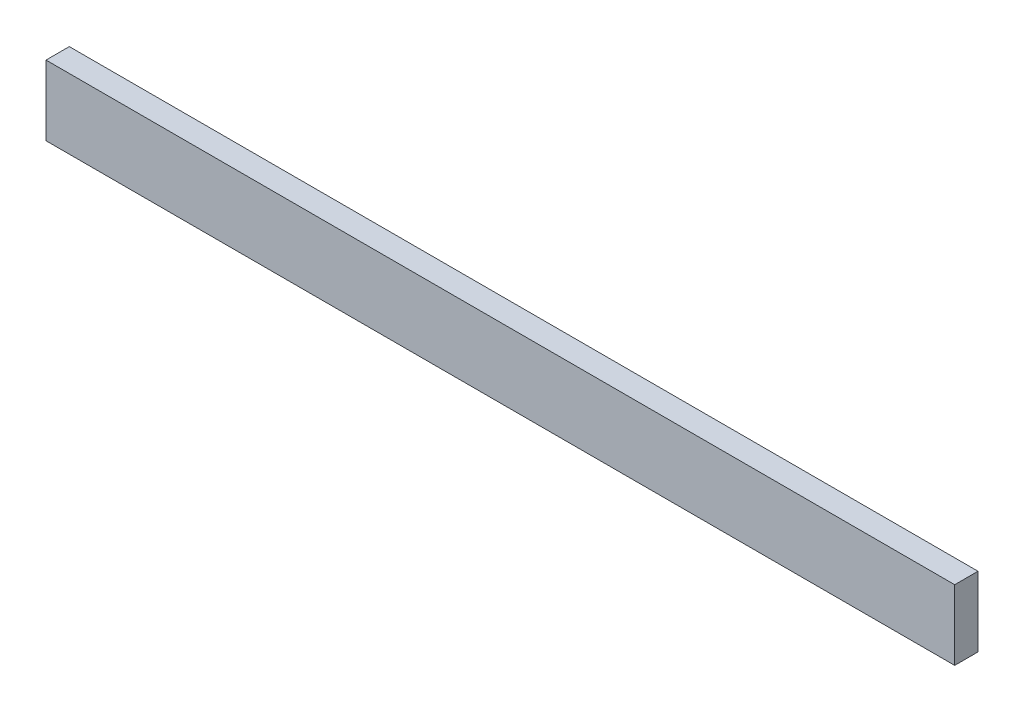
ISO-10303-21;
HEADER;
FILE_DESCRIPTION(('STEP AP214'),'2;1');
FILE_NAME('part.step','',(''),(''),'','','');
FILE_SCHEMA(('AUTOMOTIVE_DESIGN { 1 0 10303 214 1 1 1 1 }'));
ENDSEC;
DATA;
#1=APPLICATION_CONTEXT('core data for automotive mechanical design processes');
#2=APPLICATION_PROTOCOL_DEFINITION('international standard','automotive_design',2000,#1);
#3=PRODUCT_CONTEXT('',#1,'mechanical');
#4=PRODUCT('Part','Part','',(#3));
#5=PRODUCT_RELATED_PRODUCT_CATEGORY('part','',(#4));
#6=PRODUCT_DEFINITION_FORMATION('','',#4);
#7=PRODUCT_DEFINITION_CONTEXT('part definition',#1,'design');
#8=PRODUCT_DEFINITION('design','',#6,#7);
#9=PRODUCT_DEFINITION_SHAPE('','',#8);
#10=(LENGTH_UNIT() NAMED_UNIT(*) SI_UNIT(.MILLI.,.METRE.));
#11=(NAMED_UNIT(*) PLANE_ANGLE_UNIT() SI_UNIT($,.RADIAN.));
#12=(NAMED_UNIT(*) SI_UNIT($,.STERADIAN.) SOLID_ANGLE_UNIT());
#13=UNCERTAINTY_MEASURE_WITH_UNIT(LENGTH_MEASURE(1.E-05),#10,'distance_accuracy_value','');
#14=(GEOMETRIC_REPRESENTATION_CONTEXT(3) GLOBAL_UNCERTAINTY_ASSIGNED_CONTEXT((#13)) GLOBAL_UNIT_ASSIGNED_CONTEXT((#10,
#11,#12)) REPRESENTATION_CONTEXT('',''));
#15=CARTESIAN_POINT('',(0.,0.,0.));
#16=DIRECTION('',(0.,0.,1.));
#17=DIRECTION('',(1.,0.,0.));
#18=AXIS2_PLACEMENT_3D('',#15,#16,#17);
#19=CARTESIAN_POINT('',(0.,0.,6.35));
#20=DIRECTION('',(1.,0.,0.));
#21=DIRECTION('',(0.,0.,-1.));
#22=AXIS2_PLACEMENT_3D('',#19,#20,#21);
#23=PLANE('',#22);
#24=DIRECTION('',(0.,-1.,0.));
#25=VECTOR('',#24,1.);
#26=CARTESIAN_POINT('',(0.,0.,0.));
#27=LINE('',#26,#25);
#28=CARTESIAN_POINT('',(0.,19.05,0.));
#29=VERTEX_POINT('',#28);
#30=CARTESIAN_POINT('',(0.,0.,0.));
#31=VERTEX_POINT('',#30);
#32=EDGE_CURVE('E107',#29,#31,#27,.T.);
#33=ORIENTED_EDGE('',*,*,#32,.T.);
#34=DIRECTION('',(0.,0.,-1.));
#35=VECTOR('',#34,1.);
#36=CARTESIAN_POINT('',(0.,0.,6.35));
#37=LINE('',#36,#35);
#38=CARTESIAN_POINT('',(0.,0.,6.35));
#39=VERTEX_POINT('',#38);
#40=EDGE_CURVE('E11',#39,#31,#37,.T.);
#41=ORIENTED_EDGE('',*,*,#40,.F.);
#42=DIRECTION('',(0.,-1.,0.));
#43=VECTOR('',#42,1.);
#44=CARTESIAN_POINT('',(0.,0.,6.35));
#45=LINE('',#44,#43);
#46=CARTESIAN_POINT('',(0.,19.05,6.35));
#47=VERTEX_POINT('',#46);
#48=EDGE_CURVE('E91',#47,#39,#45,.T.);
#49=ORIENTED_EDGE('',*,*,#48,.F.);
#50=DIRECTION('',(0.,0.,-1.));
#51=VECTOR('',#50,1.);
#52=CARTESIAN_POINT('',(0.,19.05,6.35));
#53=LINE('',#52,#51);
#54=EDGE_CURVE('E103',#47,#29,#53,.T.);
#55=ORIENTED_EDGE('',*,*,#54,.T.);
#56=EDGE_LOOP('',(#33,#41,#49,#55));
#57=FACE_BOUND('',#56,.T.);
#58=ADVANCED_FACE('F39',(#57),#23,.F.);
#59=CARTESIAN_POINT('',(0.,0.,6.35));
#60=DIRECTION('',(0.,1.,0.));
#61=DIRECTION('',(0.,0.,1.));
#62=AXIS2_PLACEMENT_3D('',#59,#60,#61);
#63=PLANE('',#62);
#64=DIRECTION('',(1.,0.,0.));
#65=VECTOR('',#64,1.);
#66=CARTESIAN_POINT('',(0.,0.,0.));
#67=LINE('',#66,#65);
#68=CARTESIAN_POINT('',(247.65,0.,0.));
#69=VERTEX_POINT('',#68);
#70=EDGE_CURVE('E96',#31,#69,#67,.T.);
#71=ORIENTED_EDGE('',*,*,#70,.T.);
#72=DIRECTION('',(0.,0.,-1.));
#73=VECTOR('',#72,1.);
#74=CARTESIAN_POINT('',(247.65,0.,6.35));
#75=LINE('',#74,#73);
#76=CARTESIAN_POINT('',(247.65,0.,6.35));
#77=VERTEX_POINT('',#76);
#78=EDGE_CURVE('E48',#77,#69,#75,.T.);
#79=ORIENTED_EDGE('',*,*,#78,.F.);
#80=DIRECTION('',(1.,0.,0.));
#81=VECTOR('',#80,1.);
#82=CARTESIAN_POINT('',(0.,0.,6.35));
#83=LINE('',#82,#81);
#84=EDGE_CURVE('E86',#39,#77,#83,.T.);
#85=ORIENTED_EDGE('',*,*,#84,.F.);
#86=ORIENTED_EDGE('',*,*,#40,.T.);
#87=EDGE_LOOP('',(#71,#79,#85,#86));
#88=FACE_BOUND('',#87,.T.);
#89=ADVANCED_FACE('F95',(#88),#63,.F.);
#90=CARTESIAN_POINT('',(247.65,0.,6.35));
#91=DIRECTION('',(-1.,0.,0.));
#92=DIRECTION('',(0.,0.,1.));
#93=AXIS2_PLACEMENT_3D('',#90,#91,#92);
#94=PLANE('',#93);
#95=DIRECTION('',(0.,1.,0.));
#96=VECTOR('',#95,1.);
#97=CARTESIAN_POINT('',(247.65,0.,0.));
#98=LINE('',#97,#96);
#99=CARTESIAN_POINT('',(247.65,19.05,0.));
#100=VERTEX_POINT('',#99);
#101=EDGE_CURVE('E73',#69,#100,#98,.T.);
#102=ORIENTED_EDGE('',*,*,#101,.T.);
#103=DIRECTION('',(0.,0.,-1.));
#104=VECTOR('',#103,1.);
#105=CARTESIAN_POINT('',(247.65,19.05,6.35));
#106=LINE('',#105,#104);
#107=CARTESIAN_POINT('',(247.65,19.05,6.35));
#108=VERTEX_POINT('',#107);
#109=EDGE_CURVE('E98',#108,#100,#106,.T.);
#110=ORIENTED_EDGE('',*,*,#109,.F.);
#111=DIRECTION('',(0.,1.,0.));
#112=VECTOR('',#111,1.);
#113=CARTESIAN_POINT('',(247.65,0.,6.35));
#114=LINE('',#113,#112);
#115=EDGE_CURVE('E89',#77,#108,#114,.T.);
#116=ORIENTED_EDGE('',*,*,#115,.F.);
#117=ORIENTED_EDGE('',*,*,#78,.T.);
#118=EDGE_LOOP('',(#102,#110,#116,#117));
#119=FACE_BOUND('',#118,.T.);
#120=ADVANCED_FACE('F99',(#119),#94,.F.);
#121=CARTESIAN_POINT('',(0.,19.05,6.35));
#122=DIRECTION('',(0.,-1.,0.));
#123=DIRECTION('',(0.,0.,-1.));
#124=AXIS2_PLACEMENT_3D('',#121,#122,#123);
#125=PLANE('',#124);
#126=DIRECTION('',(-1.,0.,0.));
#127=VECTOR('',#126,1.);
#128=CARTESIAN_POINT('',(0.,19.05,0.));
#129=LINE('',#128,#127);
#130=EDGE_CURVE('E79',#100,#29,#129,.T.);
#131=ORIENTED_EDGE('',*,*,#130,.T.);
#132=ORIENTED_EDGE('',*,*,#54,.F.);
#133=DIRECTION('',(-1.,0.,0.));
#134=VECTOR('',#133,1.);
#135=CARTESIAN_POINT('',(0.,19.05,6.35));
#136=LINE('',#135,#134);
#137=EDGE_CURVE('E56',#108,#47,#136,.T.);
#138=ORIENTED_EDGE('',*,*,#137,.F.);
#139=ORIENTED_EDGE('',*,*,#109,.T.);
#140=EDGE_LOOP('',(#131,#132,#138,#139));
#141=FACE_BOUND('',#140,.T.);
#142=ADVANCED_FACE('F120',(#141),#125,.F.);
#143=CARTESIAN_POINT('',(0.,0.,6.35));
#144=DIRECTION('',(0.,0.,-1.));
#145=DIRECTION('',(-1.,0.,0.));
#146=AXIS2_PLACEMENT_3D('',#143,#144,#145);
#147=PLANE('',#146);
#148=ORIENTED_EDGE('',*,*,#48,.T.);
#149=ORIENTED_EDGE('',*,*,#84,.T.);
#150=ORIENTED_EDGE('',*,*,#115,.T.);
#151=ORIENTED_EDGE('',*,*,#137,.T.);
#152=EDGE_LOOP('',(#148,#149,#150,#151));
#153=FACE_BOUND('',#152,.T.);
#154=ADVANCED_FACE('F87',(#153),#147,.F.);
#155=CARTESIAN_POINT('',(0.,0.,0.));
#156=DIRECTION('',(0.,0.,-1.));
#157=DIRECTION('',(-1.,0.,0.));
#158=AXIS2_PLACEMENT_3D('',#155,#156,#157);
#159=PLANE('',#158);
#160=ORIENTED_EDGE('',*,*,#32,.F.);
#161=ORIENTED_EDGE('',*,*,#130,.F.);
#162=ORIENTED_EDGE('',*,*,#101,.F.);
#163=ORIENTED_EDGE('',*,*,#70,.F.);
#164=EDGE_LOOP('',(#160,#161,#162,#163));
#165=FACE_BOUND('',#164,.T.);
#166=ADVANCED_FACE('F123',(#165),#159,.T.);
#167=CLOSED_SHELL('',(#58,#89,#120,#142,#154,#166));
#168=MANIFOLD_SOLID_BREP('B2',#167);
#169=ADVANCED_BREP_SHAPE_REPRESENTATION('',(#18,#168),#14);
#170=SHAPE_DEFINITION_REPRESENTATION(#9,#169);
ENDSEC;
END-ISO-10303-21;
